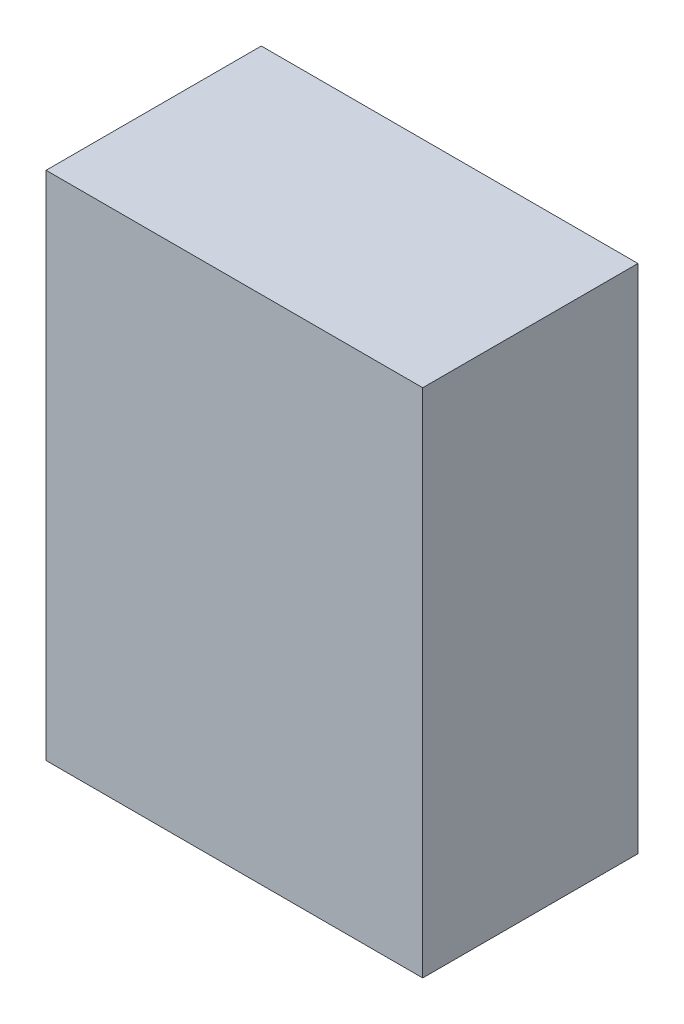
ISO-10303-21;
HEADER;
FILE_DESCRIPTION(('STEP AP214'),'2;1');
FILE_NAME('part.step','',(''),(''),'','','');
FILE_SCHEMA(('AUTOMOTIVE_DESIGN { 1 0 10303 214 1 1 1 1 }'));
ENDSEC;
DATA;
#1=APPLICATION_CONTEXT('core data for automotive mechanical design processes');
#2=APPLICATION_PROTOCOL_DEFINITION('international standard','automotive_design',2000,#1);
#3=PRODUCT_CONTEXT('',#1,'mechanical');
#4=PRODUCT('Part','Part','',(#3));
#5=PRODUCT_RELATED_PRODUCT_CATEGORY('part','',(#4));
#6=PRODUCT_DEFINITION_FORMATION('','',#4);
#7=PRODUCT_DEFINITION_CONTEXT('part definition',#1,'design');
#8=PRODUCT_DEFINITION('design','',#6,#7);
#9=PRODUCT_DEFINITION_SHAPE('','',#8);
#10=(LENGTH_UNIT() NAMED_UNIT(*) SI_UNIT(.MILLI.,.METRE.));
#11=(NAMED_UNIT(*) PLANE_ANGLE_UNIT() SI_UNIT($,.RADIAN.));
#12=(NAMED_UNIT(*) SI_UNIT($,.STERADIAN.) SOLID_ANGLE_UNIT());
#13=UNCERTAINTY_MEASURE_WITH_UNIT(LENGTH_MEASURE(1.E-05),#10,'distance_accuracy_value','');
#14=(GEOMETRIC_REPRESENTATION_CONTEXT(3) GLOBAL_UNCERTAINTY_ASSIGNED_CONTEXT((#13)) GLOBAL_UNIT_ASSIGNED_CONTEXT((#10,
#11,#12)) REPRESENTATION_CONTEXT('',''));
#15=CARTESIAN_POINT('',(0.,0.,0.));
#16=DIRECTION('',(0.,0.,1.));
#17=DIRECTION('',(1.,0.,0.));
#18=AXIS2_PLACEMENT_3D('',#15,#16,#17);
#19=CARTESIAN_POINT('',(-150.968992248062,47.1317829457365,40.));
#20=DIRECTION('',(1.,0.,0.));
#21=DIRECTION('',(0.,0.,-1.));
#22=AXIS2_PLACEMENT_3D('',#19,#20,#21);
#23=PLANE('',#22);
#24=DIRECTION('',(0.,-1.,0.));
#25=VECTOR('',#24,1.);
#26=CARTESIAN_POINT('',(-150.968992248062,47.1317829457365,0.));
#27=LINE('',#26,#25);
#28=CARTESIAN_POINT('',(-150.968992248062,47.1317829457365,0.));
#29=VERTEX_POINT('',#28);
#30=CARTESIAN_POINT('',(-150.968992248062,-47.8682170542635,0.));
#31=VERTEX_POINT('',#30);
#32=EDGE_CURVE('E107',#29,#31,#27,.T.);
#33=ORIENTED_EDGE('',*,*,#32,.T.);
#34=DIRECTION('',(0.,0.,-1.));
#35=VECTOR('',#34,1.);
#36=CARTESIAN_POINT('',(-150.968992248062,-47.8682170542635,40.));
#37=LINE('',#36,#35);
#38=CARTESIAN_POINT('',(-150.968992248062,-47.8682170542635,40.));
#39=VERTEX_POINT('',#38);
#40=EDGE_CURVE('E11',#39,#31,#37,.T.);
#41=ORIENTED_EDGE('',*,*,#40,.F.);
#42=DIRECTION('',(0.,-1.,0.));
#43=VECTOR('',#42,1.);
#44=CARTESIAN_POINT('',(-150.968992248062,47.1317829457365,40.));
#45=LINE('',#44,#43);
#46=CARTESIAN_POINT('',(-150.968992248062,47.1317829457365,40.));
#47=VERTEX_POINT('',#46);
#48=EDGE_CURVE('E91',#47,#39,#45,.T.);
#49=ORIENTED_EDGE('',*,*,#48,.F.);
#50=DIRECTION('',(0.,0.,-1.));
#51=VECTOR('',#50,1.);
#52=CARTESIAN_POINT('',(-150.968992248062,47.1317829457365,40.));
#53=LINE('',#52,#51);
#54=EDGE_CURVE('E103',#47,#29,#53,.T.);
#55=ORIENTED_EDGE('',*,*,#54,.T.);
#56=EDGE_LOOP('',(#33,#41,#49,#55));
#57=FACE_BOUND('',#56,.T.);
#58=ADVANCED_FACE('F39',(#57),#23,.F.);
#59=CARTESIAN_POINT('',(-150.968992248062,-47.8682170542635,40.));
#60=DIRECTION('',(0.,1.,0.));
#61=DIRECTION('',(-1.,0.,0.));
#62=AXIS2_PLACEMENT_3D('',#59,#60,#61);
#63=PLANE('',#62);
#64=DIRECTION('',(1.,0.,0.));
#65=VECTOR('',#64,1.);
#66=CARTESIAN_POINT('',(-150.968992248062,-47.8682170542635,0.));
#67=LINE('',#66,#65);
#68=CARTESIAN_POINT('',(-80.9689922480621,-47.8682170542635,0.));
#69=VERTEX_POINT('',#68);
#70=EDGE_CURVE('E96',#31,#69,#67,.T.);
#71=ORIENTED_EDGE('',*,*,#70,.T.);
#72=DIRECTION('',(0.,0.,-1.));
#73=VECTOR('',#72,1.);
#74=CARTESIAN_POINT('',(-80.9689922480621,-47.8682170542635,40.));
#75=LINE('',#74,#73);
#76=CARTESIAN_POINT('',(-80.9689922480621,-47.8682170542635,40.));
#77=VERTEX_POINT('',#76);
#78=EDGE_CURVE('E48',#77,#69,#75,.T.);
#79=ORIENTED_EDGE('',*,*,#78,.F.);
#80=DIRECTION('',(1.,0.,0.));
#81=VECTOR('',#80,1.);
#82=CARTESIAN_POINT('',(-150.968992248062,-47.8682170542635,40.));
#83=LINE('',#82,#81);
#84=EDGE_CURVE('E86',#39,#77,#83,.T.);
#85=ORIENTED_EDGE('',*,*,#84,.F.);
#86=ORIENTED_EDGE('',*,*,#40,.T.);
#87=EDGE_LOOP('',(#71,#79,#85,#86));
#88=FACE_BOUND('',#87,.T.);
#89=ADVANCED_FACE('F95',(#88),#63,.F.);
#90=CARTESIAN_POINT('',(-80.9689922480621,47.1317829457365,40.));
#91=DIRECTION('',(-1.,0.,0.));
#92=DIRECTION('',(0.,0.,1.));
#93=AXIS2_PLACEMENT_3D('',#90,#91,#92);
#94=PLANE('',#93);
#95=DIRECTION('',(0.,1.,0.));
#96=VECTOR('',#95,1.);
#97=CARTESIAN_POINT('',(-80.9689922480621,47.1317829457365,0.));
#98=LINE('',#97,#96);
#99=CARTESIAN_POINT('',(-80.9689922480621,47.1317829457365,0.));
#100=VERTEX_POINT('',#99);
#101=EDGE_CURVE('E73',#69,#100,#98,.T.);
#102=ORIENTED_EDGE('',*,*,#101,.T.);
#103=DIRECTION('',(0.,0.,-1.));
#104=VECTOR('',#103,1.);
#105=CARTESIAN_POINT('',(-80.9689922480621,47.1317829457365,40.));
#106=LINE('',#105,#104);
#107=CARTESIAN_POINT('',(-80.9689922480621,47.1317829457365,40.));
#108=VERTEX_POINT('',#107);
#109=EDGE_CURVE('E98',#108,#100,#106,.T.);
#110=ORIENTED_EDGE('',*,*,#109,.F.);
#111=DIRECTION('',(0.,1.,0.));
#112=VECTOR('',#111,1.);
#113=CARTESIAN_POINT('',(-80.9689922480621,47.1317829457365,40.));
#114=LINE('',#113,#112);
#115=EDGE_CURVE('E89',#77,#108,#114,.T.);
#116=ORIENTED_EDGE('',*,*,#115,.F.);
#117=ORIENTED_EDGE('',*,*,#78,.T.);
#118=EDGE_LOOP('',(#102,#110,#116,#117));
#119=FACE_BOUND('',#118,.T.);
#120=ADVANCED_FACE('F99',(#119),#94,.F.);
#121=CARTESIAN_POINT('',(-150.968992248062,47.1317829457365,40.));
#122=DIRECTION('',(0.,-1.,0.));
#123=DIRECTION('',(0.,0.,-1.));
#124=AXIS2_PLACEMENT_3D('',#121,#122,#123);
#125=PLANE('',#124);
#126=DIRECTION('',(-1.,0.,0.));
#127=VECTOR('',#126,1.);
#128=CARTESIAN_POINT('',(-150.968992248062,47.1317829457365,0.));
#129=LINE('',#128,#127);
#130=EDGE_CURVE('E79',#100,#29,#129,.T.);
#131=ORIENTED_EDGE('',*,*,#130,.T.);
#132=ORIENTED_EDGE('',*,*,#54,.F.);
#133=DIRECTION('',(-1.,0.,0.));
#134=VECTOR('',#133,1.);
#135=CARTESIAN_POINT('',(-150.968992248062,47.1317829457365,40.));
#136=LINE('',#135,#134);
#137=EDGE_CURVE('E56',#108,#47,#136,.T.);
#138=ORIENTED_EDGE('',*,*,#137,.F.);
#139=ORIENTED_EDGE('',*,*,#109,.T.);
#140=EDGE_LOOP('',(#131,#132,#138,#139));
#141=FACE_BOUND('',#140,.T.);
#142=ADVANCED_FACE('F120',(#141),#125,.F.);
#143=CARTESIAN_POINT('',(0.,0.,40.));
#144=DIRECTION('',(0.,0.,1.));
#145=DIRECTION('',(1.,0.,0.));
#146=AXIS2_PLACEMENT_3D('',#143,#144,#145);
#147=PLANE('',#146);
#148=ORIENTED_EDGE('',*,*,#48,.T.);
#149=ORIENTED_EDGE('',*,*,#84,.T.);
#150=ORIENTED_EDGE('',*,*,#115,.T.);
#151=ORIENTED_EDGE('',*,*,#137,.T.);
#152=EDGE_LOOP('',(#148,#149,#150,#151));
#153=FACE_BOUND('',#152,.T.);
#154=ADVANCED_FACE('F87',(#153),#147,.T.);
#155=CARTESIAN_POINT('',(0.,0.,0.));
#156=DIRECTION('',(0.,0.,1.));
#157=DIRECTION('',(1.,0.,0.));
#158=AXIS2_PLACEMENT_3D('',#155,#156,#157);
#159=PLANE('',#158);
#160=ORIENTED_EDGE('',*,*,#32,.F.);
#161=ORIENTED_EDGE('',*,*,#130,.F.);
#162=ORIENTED_EDGE('',*,*,#101,.F.);
#163=ORIENTED_EDGE('',*,*,#70,.F.);
#164=EDGE_LOOP('',(#160,#161,#162,#163));
#165=FACE_BOUND('',#164,.T.);
#166=ADVANCED_FACE('F123',(#165),#159,.F.);
#167=CLOSED_SHELL('',(#58,#89,#120,#142,#154,#166));
#168=MANIFOLD_SOLID_BREP('B2',#167);
#169=ADVANCED_BREP_SHAPE_REPRESENTATION('',(#18,#168),#14);
#170=SHAPE_DEFINITION_REPRESENTATION(#9,#169);
ENDSEC;
END-ISO-10303-21;
